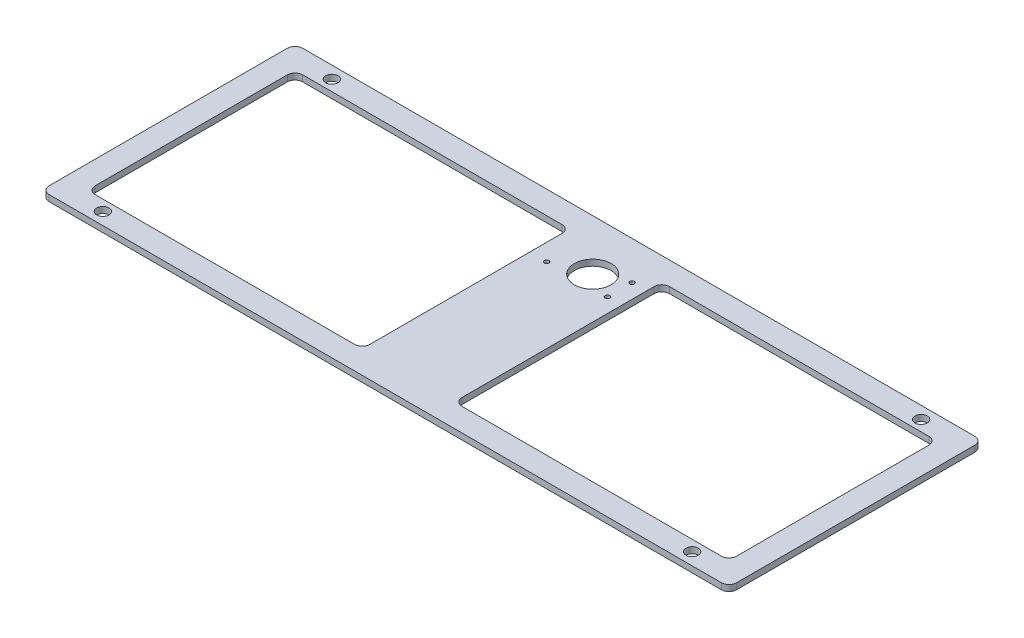
ISO-10303-21;
HEADER;
FILE_DESCRIPTION(('STEP AP214'),'2;1');
FILE_NAME('part.step','',(''),(''),'','','');
FILE_SCHEMA(('AUTOMOTIVE_DESIGN { 1 0 10303 214 1 1 1 1 }'));
ENDSEC;
DATA;
#1=APPLICATION_CONTEXT('core data for automotive mechanical design processes');
#2=APPLICATION_PROTOCOL_DEFINITION('international standard','automotive_design',2000,#1);
#3=PRODUCT_CONTEXT('',#1,'mechanical');
#4=PRODUCT('Part','Part','',(#3));
#5=PRODUCT_RELATED_PRODUCT_CATEGORY('part','',(#4));
#6=PRODUCT_DEFINITION_FORMATION('','',#4);
#7=PRODUCT_DEFINITION_CONTEXT('part definition',#1,'design');
#8=PRODUCT_DEFINITION('design','',#6,#7);
#9=PRODUCT_DEFINITION_SHAPE('','',#8);
#10=(LENGTH_UNIT() NAMED_UNIT(*) SI_UNIT(.MILLI.,.METRE.));
#11=(NAMED_UNIT(*) PLANE_ANGLE_UNIT() SI_UNIT($,.RADIAN.));
#12=(NAMED_UNIT(*) SI_UNIT($,.STERADIAN.) SOLID_ANGLE_UNIT());
#13=UNCERTAINTY_MEASURE_WITH_UNIT(LENGTH_MEASURE(1.E-05),#10,'distance_accuracy_value','');
#14=(GEOMETRIC_REPRESENTATION_CONTEXT(3) GLOBAL_UNCERTAINTY_ASSIGNED_CONTEXT((#13)) GLOBAL_UNIT_ASSIGNED_CONTEXT((#10,
#11,#12)) REPRESENTATION_CONTEXT('',''));
#15=CARTESIAN_POINT('',(0.,0.,0.));
#16=DIRECTION('',(0.,0.,1.));
#17=DIRECTION('',(1.,0.,0.));
#18=AXIS2_PLACEMENT_3D('',#15,#16,#17);
#19=CARTESIAN_POINT('',(-60.9595687331536,-2.,-49.455525606469));
#20=DIRECTION('',(0.,0.,-1.));
#21=DIRECTION('',(-1.,0.,0.));
#22=AXIS2_PLACEMENT_3D('',#19,#20,#21);
#23=PLANE('',#22);
#24=DIRECTION('',(-1.,0.,0.));
#25=VECTOR('',#24,1.);
#26=CARTESIAN_POINT('',(-60.9595687331536,0.,-49.455525606469));
#27=LINE('',#26,#25);
#28=CARTESIAN_POINT('',(148.540431266846,0.,-49.455525606469));
#29=VERTEX_POINT('',#28);
#30=CARTESIAN_POINT('',(-70.4595687331536,0.,-49.455525606469));
#31=VERTEX_POINT('',#30);
#32=EDGE_CURVE('E311',#29,#31,#27,.T.);
#33=ORIENTED_EDGE('',*,*,#32,.F.);
#34=DIRECTION('',(0.,1.,0.));
#35=VECTOR('',#34,1.);
#36=CARTESIAN_POINT('',(148.540431266846,-2.,-49.455525606469));
#37=LINE('',#36,#35);
#38=CARTESIAN_POINT('',(148.540431266846,-2.,-49.455525606469));
#39=VERTEX_POINT('',#38);
#40=EDGE_CURVE('E208',#29,#39,#37,.F.);
#41=ORIENTED_EDGE('',*,*,#40,.T.);
#42=DIRECTION('',(-1.,0.,0.));
#43=VECTOR('',#42,1.);
#44=CARTESIAN_POINT('',(-60.9595687331536,-2.,-49.455525606469));
#45=LINE('',#44,#43);
#46=CARTESIAN_POINT('',(-70.4595687331536,-2.,-49.455525606469));
#47=VERTEX_POINT('',#46);
#48=EDGE_CURVE('E310',#39,#47,#45,.T.);
#49=ORIENTED_EDGE('',*,*,#48,.T.);
#50=DIRECTION('',(0.,-1.,0.));
#51=VECTOR('',#50,1.);
#52=CARTESIAN_POINT('',(-70.4595687331536,0.,-49.455525606469));
#53=LINE('',#52,#51);
#54=EDGE_CURVE('E213',#47,#31,#53,.F.);
#55=ORIENTED_EDGE('',*,*,#54,.T.);
#56=EDGE_LOOP('',(#33,#41,#49,#55));
#57=FACE_BOUND('',#56,.T.);
#58=ADVANCED_FACE('F40',(#57),#23,.T.);
#59=CARTESIAN_POINT('',(-60.9595687331536,-2.,33.144474393531));
#60=DIRECTION('',(0.,0.,1.));
#61=DIRECTION('',(1.,0.,0.));
#62=AXIS2_PLACEMENT_3D('',#59,#60,#61);
#63=PLANE('',#62);
#64=DIRECTION('',(1.,0.,0.));
#65=VECTOR('',#64,1.);
#66=CARTESIAN_POINT('',(-60.9595687331536,-2.,33.144474393531));
#67=LINE('',#66,#65);
#68=CARTESIAN_POINT('',(-70.4595687331536,-2.,33.144474393531));
#69=VERTEX_POINT('',#68);
#70=CARTESIAN_POINT('',(148.540431266846,-2.,33.144474393531));
#71=VERTEX_POINT('',#70);
#72=EDGE_CURVE('E307',#69,#71,#67,.T.);
#73=ORIENTED_EDGE('',*,*,#72,.T.);
#74=DIRECTION('',(0.,-1.,0.));
#75=VECTOR('',#74,1.);
#76=CARTESIAN_POINT('',(148.540431266846,0.,33.144474393531));
#77=LINE('',#76,#75);
#78=CARTESIAN_POINT('',(148.540431266846,0.,33.144474393531));
#79=VERTEX_POINT('',#78);
#80=EDGE_CURVE('E341',#71,#79,#77,.F.);
#81=ORIENTED_EDGE('',*,*,#80,.T.);
#82=DIRECTION('',(1.,0.,0.));
#83=VECTOR('',#82,1.);
#84=CARTESIAN_POINT('',(-60.9595687331536,0.,33.144474393531));
#85=LINE('',#84,#83);
#86=CARTESIAN_POINT('',(-70.4595687331536,0.,33.144474393531));
#87=VERTEX_POINT('',#86);
#88=EDGE_CURVE('E304',#87,#79,#85,.T.);
#89=ORIENTED_EDGE('',*,*,#88,.F.);
#90=DIRECTION('',(0.,1.,0.));
#91=VECTOR('',#90,1.);
#92=CARTESIAN_POINT('',(-70.4595687331536,-2.,33.144474393531));
#93=LINE('',#92,#91);
#94=EDGE_CURVE('E339',#87,#69,#93,.F.);
#95=ORIENTED_EDGE('',*,*,#94,.T.);
#96=EDGE_LOOP('',(#73,#81,#89,#95));
#97=FACE_BOUND('',#96,.T.);
#98=ADVANCED_FACE('F458',(#97),#63,.T.);
#99=CARTESIAN_POINT('',(0.,-2.,0.));
#100=DIRECTION('',(0.,1.,0.));
#101=DIRECTION('',(0.,0.,1.));
#102=AXIS2_PLACEMENT_3D('',#99,#100,#101);
#103=PLANE('',#102);
#104=CARTESIAN_POINT('',(49.3404791068463,-2.,-36.955525606469));
#105=DIRECTION('',(0.,1.,0.));
#106=DIRECTION('',(0.,0.,1.));
#107=AXIS2_PLACEMENT_3D('',#104,#105,#106);
#108=CIRCLE('',#107,0.750000000000001);
#109=CARTESIAN_POINT('',(49.3404791068463,-2.,-36.205525606469));
#110=VERTEX_POINT('',#109);
#111=EDGE_CURVE('E576',#110,#110,#108,.T.);
#112=ORIENTED_EDGE('',*,*,#111,.T.);
#113=EDGE_LOOP('',(#112));
#114=FACE_BOUND('',#113,.T.);
#115=CARTESIAN_POINT('',(49.3404791068463,-2.,-28.955525606469));
#116=DIRECTION('',(0.,1.,0.));
#117=DIRECTION('',(0.,0.,1.));
#118=AXIS2_PLACEMENT_3D('',#115,#116,#117);
#119=CIRCLE('',#118,0.750000000000001);
#120=CARTESIAN_POINT('',(49.3404791068463,-2.,-28.205525606469));
#121=VERTEX_POINT('',#120);
#122=EDGE_CURVE('E586',#121,#121,#119,.T.);
#123=ORIENTED_EDGE('',*,*,#122,.T.);
#124=EDGE_LOOP('',(#123));
#125=FACE_BOUND('',#124,.T.);
#126=CARTESIAN_POINT('',(29.5404791068463,-2.,-28.955525606469));
#127=DIRECTION('',(0.,1.,0.));
#128=DIRECTION('',(0.,0.,1.));
#129=AXIS2_PLACEMENT_3D('',#126,#127,#128);
#130=CIRCLE('',#129,0.750000000000001);
#131=CARTESIAN_POINT('',(29.5404791068463,-2.,-28.205525606469));
#132=VERTEX_POINT('',#131);
#133=EDGE_CURVE('E592',#132,#132,#130,.T.);
#134=ORIENTED_EDGE('',*,*,#133,.T.);
#135=EDGE_LOOP('',(#134));
#136=FACE_BOUND('',#135,.T.);
#137=CARTESIAN_POINT('',(40.5404791068463,-2.,-32.955525606469));
#138=DIRECTION('',(0.,1.,0.));
#139=DIRECTION('',(0.,0.,1.));
#140=AXIS2_PLACEMENT_3D('',#137,#138,#139);
#141=CIRCLE('',#140,6.);
#142=CARTESIAN_POINT('',(40.5404791068463,-2.,-26.955525606469));
#143=VERTEX_POINT('',#142);
#144=EDGE_CURVE('E596',#143,#143,#141,.T.);
#145=ORIENTED_EDGE('',*,*,#144,.T.);
#146=EDGE_LOOP('',(#145));
#147=FACE_BOUND('',#146,.T.);
#148=DIRECTION('',(-1.,0.,0.));
#149=VECTOR('',#148,1.);
#150=CARTESIAN_POINT('',(-53.4595687331536,-2.,-41.955525606469));
#151=LINE('',#150,#149);
#152=CARTESIAN_POINT('',(21.5404312668464,-2.,-41.955525606469));
#153=VERTEX_POINT('',#152);
#154=CARTESIAN_POINT('',(-62.9595687331536,-2.,-41.955525606469));
#155=VERTEX_POINT('',#154);
#156=EDGE_CURVE('E254',#153,#155,#151,.T.);
#157=ORIENTED_EDGE('',*,*,#156,.T.);
#158=CARTESIAN_POINT('',(-62.9595687331536,-2.,-39.455525606469));
#159=DIRECTION('',(0.,1.,0.));
#160=DIRECTION('',(0.,0.,1.));
#161=AXIS2_PLACEMENT_3D('',#158,#159,#160);
#162=CIRCLE('',#161,2.5);
#163=CARTESIAN_POINT('',(-65.4595687331536,-2.,-39.455525606469));
#164=VERTEX_POINT('',#163);
#165=EDGE_CURVE('E11',#155,#164,#162,.T.);
#166=ORIENTED_EDGE('',*,*,#165,.T.);
#167=DIRECTION('',(0.,0.,1.));
#168=VECTOR('',#167,1.);
#169=CARTESIAN_POINT('',(-65.4595687331536,-2.,25.644474393531));
#170=LINE('',#169,#168);
#171=CARTESIAN_POINT('',(-65.4595687331536,-2.,23.144474393531));
#172=VERTEX_POINT('',#171);
#173=EDGE_CURVE('E231',#164,#172,#170,.T.);
#174=ORIENTED_EDGE('',*,*,#173,.T.);
#175=CARTESIAN_POINT('',(-62.9595687331536,-2.,23.144474393531));
#176=DIRECTION('',(0.,1.,0.));
#177=DIRECTION('',(0.,0.,1.));
#178=AXIS2_PLACEMENT_3D('',#175,#176,#177);
#179=CIRCLE('',#178,2.5);
#180=CARTESIAN_POINT('',(-62.9595687331536,-2.,25.644474393531));
#181=VERTEX_POINT('',#180);
#182=EDGE_CURVE('E396',#172,#181,#179,.T.);
#183=ORIENTED_EDGE('',*,*,#182,.T.);
#184=DIRECTION('',(1.,0.,0.));
#185=VECTOR('',#184,1.);
#186=CARTESIAN_POINT('',(-53.4595687331536,-2.,25.644474393531));
#187=LINE('',#186,#185);
#188=CARTESIAN_POINT('',(21.5404312668464,-2.,25.644474393531));
#189=VERTEX_POINT('',#188);
#190=EDGE_CURVE('E247',#181,#189,#187,.T.);
#191=ORIENTED_EDGE('',*,*,#190,.T.);
#192=CARTESIAN_POINT('',(21.5404312668464,-2.,23.144474393531));
#193=DIRECTION('',(0.,1.,0.));
#194=DIRECTION('',(0.,0.,1.));
#195=AXIS2_PLACEMENT_3D('',#192,#193,#194);
#196=CIRCLE('',#195,2.5);
#197=CARTESIAN_POINT('',(24.0404312668464,-2.,23.144474393531));
#198=VERTEX_POINT('',#197);
#199=EDGE_CURVE('E392',#189,#198,#196,.T.);
#200=ORIENTED_EDGE('',*,*,#199,.T.);
#201=DIRECTION('',(0.,0.,-1.));
#202=VECTOR('',#201,1.);
#203=CARTESIAN_POINT('',(24.0404312668464,-2.,-41.955525606469));
#204=LINE('',#203,#202);
#205=CARTESIAN_POINT('',(24.0404312668464,-2.,-39.455525606469));
#206=VERTEX_POINT('',#205);
#207=EDGE_CURVE('E250',#198,#206,#204,.T.);
#208=ORIENTED_EDGE('',*,*,#207,.T.);
#209=CARTESIAN_POINT('',(21.5404312668464,-2.,-39.455525606469));
#210=DIRECTION('',(0.,1.,0.));
#211=DIRECTION('',(0.,0.,1.));
#212=AXIS2_PLACEMENT_3D('',#209,#210,#211);
#213=CIRCLE('',#212,2.5);
#214=EDGE_CURVE('E404',#206,#153,#213,.T.);
#215=ORIENTED_EDGE('',*,*,#214,.T.);
#216=EDGE_LOOP('',(#157,#166,#174,#183,#191,#200,#208,#215));
#217=FACE_BOUND('',#216,.T.);
#218=DIRECTION('',(1.,0.,0.));
#219=VECTOR('',#218,1.);
#220=CARTESIAN_POINT('',(54.0404312668464,-2.,25.644474393531));
#221=LINE('',#220,#219);
#222=CARTESIAN_POINT('',(56.5404312668464,-2.,25.644474393531));
#223=VERTEX_POINT('',#222);
#224=CARTESIAN_POINT('',(141.040431266846,-2.,25.6444743935309));
#225=VERTEX_POINT('',#224);
#226=EDGE_CURVE('E270',#223,#225,#221,.T.);
#227=ORIENTED_EDGE('',*,*,#226,.T.);
#228=CARTESIAN_POINT('',(141.040431266846,-2.,23.1444743935309));
#229=DIRECTION('',(0.,1.,0.));
#230=DIRECTION('',(0.,0.,1.));
#231=AXIS2_PLACEMENT_3D('',#228,#229,#230);
#232=CIRCLE('',#231,2.5);
#233=CARTESIAN_POINT('',(143.540431266846,-2.,23.1444743935309));
#234=VERTEX_POINT('',#233);
#235=EDGE_CURVE('E384',#225,#234,#232,.T.);
#236=ORIENTED_EDGE('',*,*,#235,.T.);
#237=DIRECTION('',(0.,0.,-1.));
#238=VECTOR('',#237,1.);
#239=CARTESIAN_POINT('',(143.540431266846,-2.,25.6444743935309));
#240=LINE('',#239,#238);
#241=CARTESIAN_POINT('',(143.540431266846,-2.,-39.455525606469));
#242=VERTEX_POINT('',#241);
#243=EDGE_CURVE('E601',#234,#242,#240,.T.);
#244=ORIENTED_EDGE('',*,*,#243,.T.);
#245=CARTESIAN_POINT('',(141.040431266846,-2.,-39.455525606469));
#246=DIRECTION('',(0.,1.,0.));
#247=DIRECTION('',(0.,0.,1.));
#248=AXIS2_PLACEMENT_3D('',#245,#246,#247);
#249=CIRCLE('',#248,2.5);
#250=CARTESIAN_POINT('',(141.040431266846,-2.,-41.955525606469));
#251=VERTEX_POINT('',#250);
#252=EDGE_CURVE('E380',#242,#251,#249,.T.);
#253=ORIENTED_EDGE('',*,*,#252,.T.);
#254=DIRECTION('',(-1.,0.,0.));
#255=VECTOR('',#254,1.);
#256=CARTESIAN_POINT('',(54.0404312668464,-2.,-41.955525606469));
#257=LINE('',#256,#255);
#258=CARTESIAN_POINT('',(56.5404312668464,-2.,-41.955525606469));
#259=VERTEX_POINT('',#258);
#260=EDGE_CURVE('E262',#251,#259,#257,.T.);
#261=ORIENTED_EDGE('',*,*,#260,.T.);
#262=CARTESIAN_POINT('',(56.5404312668464,-2.,-39.455525606469));
#263=DIRECTION('',(0.,1.,0.));
#264=DIRECTION('',(0.,0.,1.));
#265=AXIS2_PLACEMENT_3D('',#262,#263,#264);
#266=CIRCLE('',#265,2.5);
#267=CARTESIAN_POINT('',(54.0404312668464,-2.,-39.455525606469));
#268=VERTEX_POINT('',#267);
#269=EDGE_CURVE('E400',#259,#268,#266,.T.);
#270=ORIENTED_EDGE('',*,*,#269,.T.);
#271=DIRECTION('',(0.,0.,1.));
#272=VECTOR('',#271,1.);
#273=CARTESIAN_POINT('',(54.0404312668464,-2.,-41.955525606469));
#274=LINE('',#273,#272);
#275=CARTESIAN_POINT('',(54.0404312668464,-2.,23.144474393531));
#276=VERTEX_POINT('',#275);
#277=EDGE_CURVE('E267',#268,#276,#274,.T.);
#278=ORIENTED_EDGE('',*,*,#277,.T.);
#279=CARTESIAN_POINT('',(56.5404312668464,-2.,23.144474393531));
#280=DIRECTION('',(0.,1.,0.));
#281=DIRECTION('',(0.,0.,1.));
#282=AXIS2_PLACEMENT_3D('',#279,#280,#281);
#283=CIRCLE('',#282,2.5);
#284=EDGE_CURVE('E388',#276,#223,#283,.T.);
#285=ORIENTED_EDGE('',*,*,#284,.T.);
#286=EDGE_LOOP('',(#227,#236,#244,#253,#261,#270,#278,#285));
#287=FACE_BOUND('',#286,.T.);
#288=CARTESIAN_POINT('',(135.040431266846,-2.,-45.455525606469));
#289=DIRECTION('',(0.,1.,0.));
#290=DIRECTION('',(0.,0.,1.));
#291=AXIS2_PLACEMENT_3D('',#288,#289,#290);
#292=CIRCLE('',#291,2.);
#293=CARTESIAN_POINT('',(135.040431266846,-2.,-43.455525606469));
#294=VERTEX_POINT('',#293);
#295=EDGE_CURVE('E296',#294,#294,#292,.T.);
#296=ORIENTED_EDGE('',*,*,#295,.T.);
#297=EDGE_LOOP('',(#296));
#298=FACE_BOUND('',#297,.T.);
#299=CARTESIAN_POINT('',(135.040431266846,-2.,29.144474393531));
#300=DIRECTION('',(0.,1.,0.));
#301=DIRECTION('',(0.,0.,1.));
#302=AXIS2_PLACEMENT_3D('',#299,#300,#301);
#303=CIRCLE('',#302,2.);
#304=CARTESIAN_POINT('',(135.040431266846,-2.,31.144474393531));
#305=VERTEX_POINT('',#304);
#306=EDGE_CURVE('E290',#305,#305,#303,.T.);
#307=ORIENTED_EDGE('',*,*,#306,.T.);
#308=EDGE_LOOP('',(#307));
#309=FACE_BOUND('',#308,.T.);
#310=CARTESIAN_POINT('',(-56.9595687331536,-2.,29.144474393531));
#311=DIRECTION('',(0.,1.,0.));
#312=DIRECTION('',(0.,0.,1.));
#313=AXIS2_PLACEMENT_3D('',#310,#311,#312);
#314=CIRCLE('',#313,2.);
#315=CARTESIAN_POINT('',(-56.9595687331536,-2.,31.144474393531));
#316=VERTEX_POINT('',#315);
#317=EDGE_CURVE('E283',#316,#316,#314,.T.);
#318=ORIENTED_EDGE('',*,*,#317,.T.);
#319=EDGE_LOOP('',(#318));
#320=FACE_BOUND('',#319,.T.);
#321=CARTESIAN_POINT('',(-56.9595687331536,-2.,-45.455525606469));
#322=DIRECTION('',(0.,1.,0.));
#323=DIRECTION('',(0.,0.,1.));
#324=AXIS2_PLACEMENT_3D('',#321,#322,#323);
#325=CIRCLE('',#324,2.);
#326=CARTESIAN_POINT('',(-56.9595687331536,-2.,-43.455525606469));
#327=VERTEX_POINT('',#326);
#328=EDGE_CURVE('E301',#327,#327,#325,.T.);
#329=ORIENTED_EDGE('',*,*,#328,.T.);
#330=EDGE_LOOP('',(#329));
#331=FACE_BOUND('',#330,.T.);
#332=ORIENTED_EDGE('',*,*,#48,.F.);
#333=CARTESIAN_POINT('',(148.540431266846,-2.,-46.955525606469));
#334=DIRECTION('',(0.,1.,0.));
#335=DIRECTION('',(0.,0.,1.));
#336=AXIS2_PLACEMENT_3D('',#333,#334,#335);
#337=CIRCLE('',#336,2.5);
#338=CARTESIAN_POINT('',(151.040431266846,-2.,-46.955525606469));
#339=VERTEX_POINT('',#338);
#340=EDGE_CURVE('E327',#39,#339,#337,.F.);
#341=ORIENTED_EDGE('',*,*,#340,.T.);
#342=DIRECTION('',(0.,0.,-1.));
#343=VECTOR('',#342,1.);
#344=CARTESIAN_POINT('',(151.040431266846,-2.,-49.455525606469));
#345=LINE('',#344,#343);
#346=CARTESIAN_POINT('',(151.040431266846,-2.,30.644474393531));
#347=VERTEX_POINT('',#346);
#348=EDGE_CURVE('E224',#347,#339,#345,.T.);
#349=ORIENTED_EDGE('',*,*,#348,.F.);
#350=CARTESIAN_POINT('',(148.540431266846,-2.,30.644474393531));
#351=DIRECTION('',(0.,1.,0.));
#352=DIRECTION('',(0.,0.,1.));
#353=AXIS2_PLACEMENT_3D('',#350,#351,#352);
#354=CIRCLE('',#353,2.5);
#355=EDGE_CURVE('E325',#347,#71,#354,.F.);
#356=ORIENTED_EDGE('',*,*,#355,.T.);
#357=ORIENTED_EDGE('',*,*,#72,.F.);
#358=CARTESIAN_POINT('',(-70.4595687331536,-2.,30.644474393531));
#359=DIRECTION('',(0.,1.,0.));
#360=DIRECTION('',(0.,0.,1.));
#361=AXIS2_PLACEMENT_3D('',#358,#359,#360);
#362=CIRCLE('',#361,2.5);
#363=CARTESIAN_POINT('',(-72.9595687331536,-2.,30.644474393531));
#364=VERTEX_POINT('',#363);
#365=EDGE_CURVE('E55',#69,#364,#362,.F.);
#366=ORIENTED_EDGE('',*,*,#365,.T.);
#367=DIRECTION('',(0.,0.,1.));
#368=VECTOR('',#367,1.);
#369=CARTESIAN_POINT('',(-72.9595687331536,-2.,-49.455525606469));
#370=LINE('',#369,#368);
#371=CARTESIAN_POINT('',(-72.9595687331536,-2.,-46.955525606469));
#372=VERTEX_POINT('',#371);
#373=EDGE_CURVE('E233',#372,#364,#370,.T.);
#374=ORIENTED_EDGE('',*,*,#373,.F.);
#375=CARTESIAN_POINT('',(-70.4595687331536,-2.,-46.955525606469));
#376=DIRECTION('',(0.,1.,0.));
#377=DIRECTION('',(0.,0.,1.));
#378=AXIS2_PLACEMENT_3D('',#375,#376,#377);
#379=CIRCLE('',#378,2.5);
#380=EDGE_CURVE('E63',#372,#47,#379,.F.);
#381=ORIENTED_EDGE('',*,*,#380,.T.);
#382=EDGE_LOOP('',(#332,#341,#349,#356,#357,#366,#374,#381));
#383=FACE_BOUND('',#382,.T.);
#384=ADVANCED_FACE('F421',(#114,#125,#136,#147,#217,#287,#298,#309,#320,#331,#383),#103,.F.);
#385=CARTESIAN_POINT('',(0.,0.,0.));
#386=DIRECTION('',(0.,1.,0.));
#387=DIRECTION('',(0.,0.,1.));
#388=AXIS2_PLACEMENT_3D('',#385,#386,#387);
#389=PLANE('',#388);
#390=CARTESIAN_POINT('',(49.3404791068463,0.,-36.955525606469));
#391=DIRECTION('',(0.,1.,0.));
#392=DIRECTION('',(0.,0.,1.));
#393=AXIS2_PLACEMENT_3D('',#390,#391,#392);
#394=CIRCLE('',#393,0.750000000000001);
#395=CARTESIAN_POINT('',(49.3404791068463,0.,-36.205525606469));
#396=VERTEX_POINT('',#395);
#397=EDGE_CURVE('E579',#396,#396,#394,.T.);
#398=ORIENTED_EDGE('',*,*,#397,.F.);
#399=EDGE_LOOP('',(#398));
#400=FACE_BOUND('',#399,.T.);
#401=CARTESIAN_POINT('',(49.3404791068463,0.,-28.955525606469));
#402=DIRECTION('',(0.,1.,0.));
#403=DIRECTION('',(0.,0.,1.));
#404=AXIS2_PLACEMENT_3D('',#401,#402,#403);
#405=CIRCLE('',#404,0.750000000000001);
#406=CARTESIAN_POINT('',(49.3404791068463,0.,-28.205525606469));
#407=VERTEX_POINT('',#406);
#408=EDGE_CURVE('E581',#407,#407,#405,.T.);
#409=ORIENTED_EDGE('',*,*,#408,.F.);
#410=EDGE_LOOP('',(#409));
#411=FACE_BOUND('',#410,.T.);
#412=CARTESIAN_POINT('',(29.5404791068463,0.,-28.955525606469));
#413=DIRECTION('',(0.,1.,0.));
#414=DIRECTION('',(0.,0.,1.));
#415=AXIS2_PLACEMENT_3D('',#412,#413,#414);
#416=CIRCLE('',#415,0.750000000000001);
#417=CARTESIAN_POINT('',(29.5404791068463,0.,-28.205525606469));
#418=VERTEX_POINT('',#417);
#419=EDGE_CURVE('E589',#418,#418,#416,.T.);
#420=ORIENTED_EDGE('',*,*,#419,.F.);
#421=EDGE_LOOP('',(#420));
#422=FACE_BOUND('',#421,.T.);
#423=CARTESIAN_POINT('',(40.5404791068463,0.,-32.955525606469));
#424=DIRECTION('',(0.,1.,0.));
#425=DIRECTION('',(0.,0.,1.));
#426=AXIS2_PLACEMENT_3D('',#423,#424,#425);
#427=CIRCLE('',#426,6.);
#428=CARTESIAN_POINT('',(40.5404791068463,0.,-26.955525606469));
#429=VERTEX_POINT('',#428);
#430=EDGE_CURVE('E595',#429,#429,#427,.T.);
#431=ORIENTED_EDGE('',*,*,#430,.F.);
#432=EDGE_LOOP('',(#431));
#433=FACE_BOUND('',#432,.T.);
#434=DIRECTION('',(1.,0.,0.));
#435=VECTOR('',#434,1.);
#436=CARTESIAN_POINT('',(-53.4595687331536,0.,25.644474393531));
#437=LINE('',#436,#435);
#438=CARTESIAN_POINT('',(-62.9595687331536,0.,25.644474393531));
#439=VERTEX_POINT('',#438);
#440=CARTESIAN_POINT('',(21.5404312668464,0.,25.644474393531));
#441=VERTEX_POINT('',#440);
#442=EDGE_CURVE('E258',#439,#441,#437,.T.);
#443=ORIENTED_EDGE('',*,*,#442,.F.);
#444=CARTESIAN_POINT('',(-62.9595687331536,0.,23.144474393531));
#445=DIRECTION('',(0.,1.,0.));
#446=DIRECTION('',(0.,0.,1.));
#447=AXIS2_PLACEMENT_3D('',#444,#445,#446);
#448=CIRCLE('',#447,2.5);
#449=CARTESIAN_POINT('',(-65.4595687331536,0.,23.144474393531));
#450=VERTEX_POINT('',#449);
#451=EDGE_CURVE('E394',#439,#450,#448,.F.);
#452=ORIENTED_EDGE('',*,*,#451,.T.);
#453=DIRECTION('',(0.,0.,1.));
#454=VECTOR('',#453,1.);
#455=CARTESIAN_POINT('',(-65.4595687331536,0.,25.644474393531));
#456=LINE('',#455,#454);
#457=CARTESIAN_POINT('',(-65.4595687331536,0.,-39.455525606469));
#458=VERTEX_POINT('',#457);
#459=EDGE_CURVE('E236',#458,#450,#456,.T.);
#460=ORIENTED_EDGE('',*,*,#459,.F.);
#461=CARTESIAN_POINT('',(-62.9595687331536,0.,-39.455525606469));
#462=DIRECTION('',(0.,1.,0.));
#463=DIRECTION('',(0.,0.,1.));
#464=AXIS2_PLACEMENT_3D('',#461,#462,#463);
#465=CIRCLE('',#464,2.5);
#466=CARTESIAN_POINT('',(-62.9595687331536,0.,-41.955525606469));
#467=VERTEX_POINT('',#466);
#468=EDGE_CURVE('E48',#458,#467,#465,.F.);
#469=ORIENTED_EDGE('',*,*,#468,.T.);
#470=DIRECTION('',(-1.,0.,0.));
#471=VECTOR('',#470,1.);
#472=CARTESIAN_POINT('',(-53.4595687331536,0.,-41.955525606469));
#473=LINE('',#472,#471);
#474=CARTESIAN_POINT('',(21.5404312668464,0.,-41.955525606469));
#475=VERTEX_POINT('',#474);
#476=EDGE_CURVE('E251',#475,#467,#473,.T.);
#477=ORIENTED_EDGE('',*,*,#476,.F.);
#478=CARTESIAN_POINT('',(21.5404312668464,0.,-39.455525606469));
#479=DIRECTION('',(0.,1.,0.));
#480=DIRECTION('',(0.,0.,1.));
#481=AXIS2_PLACEMENT_3D('',#478,#479,#480);
#482=CIRCLE('',#481,2.5);
#483=CARTESIAN_POINT('',(24.0404312668464,0.,-39.455525606469));
#484=VERTEX_POINT('',#483);
#485=EDGE_CURVE('E402',#475,#484,#482,.F.);
#486=ORIENTED_EDGE('',*,*,#485,.T.);
#487=DIRECTION('',(0.,0.,-1.));
#488=VECTOR('',#487,1.);
#489=CARTESIAN_POINT('',(24.0404312668464,0.,-41.955525606469));
#490=LINE('',#489,#488);
#491=CARTESIAN_POINT('',(24.0404312668464,0.,23.144474393531));
#492=VERTEX_POINT('',#491);
#493=EDGE_CURVE('E261',#492,#484,#490,.T.);
#494=ORIENTED_EDGE('',*,*,#493,.F.);
#495=CARTESIAN_POINT('',(21.5404312668464,0.,23.144474393531));
#496=DIRECTION('',(0.,1.,0.));
#497=DIRECTION('',(0.,0.,1.));
#498=AXIS2_PLACEMENT_3D('',#495,#496,#497);
#499=CIRCLE('',#498,2.5);
#500=EDGE_CURVE('E390',#492,#441,#499,.F.);
#501=ORIENTED_EDGE('',*,*,#500,.T.);
#502=EDGE_LOOP('',(#443,#452,#460,#469,#477,#486,#494,#501));
#503=FACE_BOUND('',#502,.T.);
#504=DIRECTION('',(-1.,0.,0.));
#505=VECTOR('',#504,1.);
#506=CARTESIAN_POINT('',(54.0404312668464,0.,-41.955525606469));
#507=LINE('',#506,#505);
#508=CARTESIAN_POINT('',(141.040431266846,0.,-41.955525606469));
#509=VERTEX_POINT('',#508);
#510=CARTESIAN_POINT('',(56.5404312668464,0.,-41.955525606469));
#511=VERTEX_POINT('',#510);
#512=EDGE_CURVE('E271',#509,#511,#507,.T.);
#513=ORIENTED_EDGE('',*,*,#512,.F.);
#514=CARTESIAN_POINT('',(141.040431266846,0.,-39.455525606469));
#515=DIRECTION('',(0.,1.,0.));
#516=DIRECTION('',(0.,0.,1.));
#517=AXIS2_PLACEMENT_3D('',#514,#515,#516);
#518=CIRCLE('',#517,2.5);
#519=CARTESIAN_POINT('',(143.540431266846,0.,-39.455525606469));
#520=VERTEX_POINT('',#519);
#521=EDGE_CURVE('E378',#509,#520,#518,.F.);
#522=ORIENTED_EDGE('',*,*,#521,.T.);
#523=DIRECTION('',(0.,0.,-1.));
#524=VECTOR('',#523,1.);
#525=CARTESIAN_POINT('',(143.540431266846,0.,25.6444743935309));
#526=LINE('',#525,#524);
#527=CARTESIAN_POINT('',(143.540431266846,0.,23.1444743935309));
#528=VERTEX_POINT('',#527);
#529=EDGE_CURVE('E239',#528,#520,#526,.T.);
#530=ORIENTED_EDGE('',*,*,#529,.F.);
#531=CARTESIAN_POINT('',(141.040431266846,0.,23.1444743935309));
#532=DIRECTION('',(0.,1.,0.));
#533=DIRECTION('',(0.,0.,1.));
#534=AXIS2_PLACEMENT_3D('',#531,#532,#533);
#535=CIRCLE('',#534,2.5);
#536=CARTESIAN_POINT('',(141.040431266846,0.,25.6444743935309));
#537=VERTEX_POINT('',#536);
#538=EDGE_CURVE('E382',#528,#537,#535,.F.);
#539=ORIENTED_EDGE('',*,*,#538,.T.);
#540=DIRECTION('',(1.,0.,0.));
#541=VECTOR('',#540,1.);
#542=CARTESIAN_POINT('',(54.0404312668464,0.,25.644474393531));
#543=LINE('',#542,#541);
#544=CARTESIAN_POINT('',(56.5404312668464,0.,25.644474393531));
#545=VERTEX_POINT('',#544);
#546=EDGE_CURVE('E278',#545,#537,#543,.T.);
#547=ORIENTED_EDGE('',*,*,#546,.F.);
#548=CARTESIAN_POINT('',(56.5404312668464,0.,23.144474393531));
#549=DIRECTION('',(0.,1.,0.));
#550=DIRECTION('',(0.,0.,1.));
#551=AXIS2_PLACEMENT_3D('',#548,#549,#550);
#552=CIRCLE('',#551,2.5);
#553=CARTESIAN_POINT('',(54.0404312668464,0.,23.144474393531));
#554=VERTEX_POINT('',#553);
#555=EDGE_CURVE('E386',#545,#554,#552,.F.);
#556=ORIENTED_EDGE('',*,*,#555,.T.);
#557=DIRECTION('',(0.,0.,1.));
#558=VECTOR('',#557,1.);
#559=CARTESIAN_POINT('',(54.0404312668464,0.,-41.955525606469));
#560=LINE('',#559,#558);
#561=CARTESIAN_POINT('',(54.0404312668464,0.,-39.455525606469));
#562=VERTEX_POINT('',#561);
#563=EDGE_CURVE('E246',#562,#554,#560,.T.);
#564=ORIENTED_EDGE('',*,*,#563,.F.);
#565=CARTESIAN_POINT('',(56.5404312668464,0.,-39.455525606469));
#566=DIRECTION('',(0.,1.,0.));
#567=DIRECTION('',(0.,0.,1.));
#568=AXIS2_PLACEMENT_3D('',#565,#566,#567);
#569=CIRCLE('',#568,2.5);
#570=EDGE_CURVE('E398',#562,#511,#569,.F.);
#571=ORIENTED_EDGE('',*,*,#570,.T.);
#572=EDGE_LOOP('',(#513,#522,#530,#539,#547,#556,#564,#571));
#573=FACE_BOUND('',#572,.T.);
#574=CARTESIAN_POINT('',(135.040431266846,0.,-45.455525606469));
#575=DIRECTION('',(0.,1.,0.));
#576=DIRECTION('',(0.,0.,1.));
#577=AXIS2_PLACEMENT_3D('',#574,#575,#576);
#578=CIRCLE('',#577,2.);
#579=CARTESIAN_POINT('',(135.040431266846,0.,-43.455525606469));
#580=VERTEX_POINT('',#579);
#581=EDGE_CURVE('E257',#580,#580,#578,.T.);
#582=ORIENTED_EDGE('',*,*,#581,.F.);
#583=EDGE_LOOP('',(#582));
#584=FACE_BOUND('',#583,.T.);
#585=CARTESIAN_POINT('',(135.040431266846,0.,29.144474393531));
#586=DIRECTION('',(0.,1.,0.));
#587=DIRECTION('',(0.,0.,1.));
#588=AXIS2_PLACEMENT_3D('',#585,#586,#587);
#589=CIRCLE('',#588,2.);
#590=CARTESIAN_POINT('',(135.040431266846,0.,31.144474393531));
#591=VERTEX_POINT('',#590);
#592=EDGE_CURVE('E293',#591,#591,#589,.T.);
#593=ORIENTED_EDGE('',*,*,#592,.F.);
#594=EDGE_LOOP('',(#593));
#595=FACE_BOUND('',#594,.T.);
#596=CARTESIAN_POINT('',(-56.9595687331536,0.,29.144474393531));
#597=DIRECTION('',(0.,1.,0.));
#598=DIRECTION('',(0.,0.,1.));
#599=AXIS2_PLACEMENT_3D('',#596,#597,#598);
#600=CIRCLE('',#599,2.);
#601=CARTESIAN_POINT('',(-56.9595687331536,0.,31.144474393531));
#602=VERTEX_POINT('',#601);
#603=EDGE_CURVE('E287',#602,#602,#600,.T.);
#604=ORIENTED_EDGE('',*,*,#603,.F.);
#605=EDGE_LOOP('',(#604));
#606=FACE_BOUND('',#605,.T.);
#607=CARTESIAN_POINT('',(-56.9595687331536,0.,-45.455525606469));
#608=DIRECTION('',(0.,1.,0.));
#609=DIRECTION('',(0.,0.,1.));
#610=AXIS2_PLACEMENT_3D('',#607,#608,#609);
#611=CIRCLE('',#610,2.);
#612=CARTESIAN_POINT('',(-56.9595687331536,0.,-43.455525606469));
#613=VERTEX_POINT('',#612);
#614=EDGE_CURVE('E286',#613,#613,#611,.T.);
#615=ORIENTED_EDGE('',*,*,#614,.F.);
#616=EDGE_LOOP('',(#615));
#617=FACE_BOUND('',#616,.T.);
#618=DIRECTION('',(0.,0.,1.));
#619=VECTOR('',#618,1.);
#620=CARTESIAN_POINT('',(151.040431266846,0.,-49.455525606469));
#621=LINE('',#620,#619);
#622=CARTESIAN_POINT('',(151.040431266846,0.,-46.955525606469));
#623=VERTEX_POINT('',#622);
#624=CARTESIAN_POINT('',(151.040431266846,0.,30.644474393531));
#625=VERTEX_POINT('',#624);
#626=EDGE_CURVE('E221',#623,#625,#621,.T.);
#627=ORIENTED_EDGE('',*,*,#626,.F.);
#628=CARTESIAN_POINT('',(148.540431266846,0.,-46.955525606469));
#629=DIRECTION('',(0.,1.,0.));
#630=DIRECTION('',(0.,0.,1.));
#631=AXIS2_PLACEMENT_3D('',#628,#629,#630);
#632=CIRCLE('',#631,2.5);
#633=EDGE_CURVE('E203',#623,#29,#632,.T.);
#634=ORIENTED_EDGE('',*,*,#633,.T.);
#635=ORIENTED_EDGE('',*,*,#32,.T.);
#636=CARTESIAN_POINT('',(-70.4595687331536,0.,-46.955525606469));
#637=DIRECTION('',(0.,1.,0.));
#638=DIRECTION('',(0.,0.,1.));
#639=AXIS2_PLACEMENT_3D('',#636,#637,#638);
#640=CIRCLE('',#639,2.5);
#641=CARTESIAN_POINT('',(-72.9595687331536,0.,-46.955525606469));
#642=VERTEX_POINT('',#641);
#643=EDGE_CURVE('E225',#31,#642,#640,.T.);
#644=ORIENTED_EDGE('',*,*,#643,.T.);
#645=DIRECTION('',(0.,0.,-1.));
#646=VECTOR('',#645,1.);
#647=CARTESIAN_POINT('',(-72.9595687331536,0.,-49.455525606469));
#648=LINE('',#647,#646);
#649=CARTESIAN_POINT('',(-72.9595687331536,0.,30.644474393531));
#650=VERTEX_POINT('',#649);
#651=EDGE_CURVE('E243',#650,#642,#648,.T.);
#652=ORIENTED_EDGE('',*,*,#651,.F.);
#653=CARTESIAN_POINT('',(-70.4595687331536,0.,30.644474393531));
#654=DIRECTION('',(0.,1.,0.));
#655=DIRECTION('',(0.,0.,1.));
#656=AXIS2_PLACEMENT_3D('',#653,#654,#655);
#657=CIRCLE('',#656,2.5);
#658=EDGE_CURVE('E318',#650,#87,#657,.T.);
#659=ORIENTED_EDGE('',*,*,#658,.T.);
#660=ORIENTED_EDGE('',*,*,#88,.T.);
#661=CARTESIAN_POINT('',(148.540431266846,0.,30.644474393531));
#662=DIRECTION('',(0.,1.,0.));
#663=DIRECTION('',(0.,0.,1.));
#664=AXIS2_PLACEMENT_3D('',#661,#662,#663);
#665=CIRCLE('',#664,2.5);
#666=EDGE_CURVE('E214',#79,#625,#665,.T.);
#667=ORIENTED_EDGE('',*,*,#666,.T.);
#668=EDGE_LOOP('',(#627,#634,#635,#644,#652,#659,#660,#667));
#669=FACE_BOUND('',#668,.T.);
#670=ADVANCED_FACE('F228',(#400,#411,#422,#433,#503,#573,#584,#595,#606,#617,#669),#389,.T.);
#671=CARTESIAN_POINT('',(-56.9595687331536,-2.,-45.455525606469));
#672=DIRECTION('',(0.,1.,0.));
#673=DIRECTION('',(0.,0.,1.));
#674=AXIS2_PLACEMENT_3D('',#671,#672,#673);
#675=CYLINDRICAL_SURFACE('',#674,2.);
#676=ORIENTED_EDGE('',*,*,#328,.F.);
#677=EDGE_LOOP('',(#676));
#678=FACE_BOUND('',#677,.T.);
#679=ORIENTED_EDGE('',*,*,#614,.T.);
#680=EDGE_LOOP('',(#679));
#681=FACE_BOUND('',#680,.T.);
#682=ADVANCED_FACE('F510',(#678,#681),#675,.F.);
#683=CARTESIAN_POINT('',(-56.9595687331536,-2.,29.144474393531));
#684=DIRECTION('',(0.,1.,0.));
#685=DIRECTION('',(0.,0.,1.));
#686=AXIS2_PLACEMENT_3D('',#683,#684,#685);
#687=CYLINDRICAL_SURFACE('',#686,2.);
#688=ORIENTED_EDGE('',*,*,#317,.F.);
#689=EDGE_LOOP('',(#688));
#690=FACE_BOUND('',#689,.T.);
#691=ORIENTED_EDGE('',*,*,#603,.T.);
#692=EDGE_LOOP('',(#691));
#693=FACE_BOUND('',#692,.T.);
#694=ADVANCED_FACE('F517',(#690,#693),#687,.F.);
#695=CARTESIAN_POINT('',(135.040431266846,-2.,29.144474393531));
#696=DIRECTION('',(0.,1.,0.));
#697=DIRECTION('',(0.,0.,1.));
#698=AXIS2_PLACEMENT_3D('',#695,#696,#697);
#699=CYLINDRICAL_SURFACE('',#698,2.);
#700=ORIENTED_EDGE('',*,*,#306,.F.);
#701=EDGE_LOOP('',(#700));
#702=FACE_BOUND('',#701,.T.);
#703=ORIENTED_EDGE('',*,*,#592,.T.);
#704=EDGE_LOOP('',(#703));
#705=FACE_BOUND('',#704,.T.);
#706=ADVANCED_FACE('F523',(#702,#705),#699,.F.);
#707=CARTESIAN_POINT('',(135.040431266846,-2.,-45.455525606469));
#708=DIRECTION('',(0.,1.,0.));
#709=DIRECTION('',(0.,0.,1.));
#710=AXIS2_PLACEMENT_3D('',#707,#708,#709);
#711=CYLINDRICAL_SURFACE('',#710,2.);
#712=ORIENTED_EDGE('',*,*,#295,.F.);
#713=EDGE_LOOP('',(#712));
#714=FACE_BOUND('',#713,.T.);
#715=ORIENTED_EDGE('',*,*,#581,.T.);
#716=EDGE_LOOP('',(#715));
#717=FACE_BOUND('',#716,.T.);
#718=ADVANCED_FACE('F519',(#714,#717),#711,.F.);
#719=CARTESIAN_POINT('',(54.0404312668464,-2.,-41.955525606469));
#720=DIRECTION('',(-1.,0.,0.));
#721=DIRECTION('',(0.,0.,1.));
#722=AXIS2_PLACEMENT_3D('',#719,#720,#721);
#723=PLANE('',#722);
#724=ORIENTED_EDGE('',*,*,#563,.T.);
#725=DIRECTION('',(0.,1.,0.));
#726=VECTOR('',#725,1.);
#727=CARTESIAN_POINT('',(54.0404312668464,-2.,23.144474393531));
#728=LINE('',#727,#726);
#729=EDGE_CURVE('E351',#554,#276,#728,.F.);
#730=ORIENTED_EDGE('',*,*,#729,.T.);
#731=ORIENTED_EDGE('',*,*,#277,.F.);
#732=DIRECTION('',(0.,1.,0.));
#733=VECTOR('',#732,1.);
#734=CARTESIAN_POINT('',(54.0404312668464,0.,-39.455525606469));
#735=LINE('',#734,#733);
#736=EDGE_CURVE('E348',#268,#562,#735,.T.);
#737=ORIENTED_EDGE('',*,*,#736,.T.);
#738=EDGE_LOOP('',(#724,#730,#731,#737));
#739=FACE_BOUND('',#738,.T.);
#740=ADVANCED_FACE('F522',(#739),#723,.F.);
#741=CARTESIAN_POINT('',(54.0404312668464,-2.,-41.955525606469));
#742=DIRECTION('',(0.,0.,-1.));
#743=DIRECTION('',(-1.,0.,0.));
#744=AXIS2_PLACEMENT_3D('',#741,#742,#743);
#745=PLANE('',#744);
#746=ORIENTED_EDGE('',*,*,#260,.F.);
#747=DIRECTION('',(0.,1.,0.));
#748=VECTOR('',#747,1.);
#749=CARTESIAN_POINT('',(141.040431266846,0.,-41.955525606469));
#750=LINE('',#749,#748);
#751=EDGE_CURVE('E331',#251,#509,#750,.T.);
#752=ORIENTED_EDGE('',*,*,#751,.T.);
#753=ORIENTED_EDGE('',*,*,#512,.T.);
#754=DIRECTION('',(0.,1.,0.));
#755=VECTOR('',#754,1.);
#756=CARTESIAN_POINT('',(56.5404312668464,-2.,-41.955525606469));
#757=LINE('',#756,#755);
#758=EDGE_CURVE('E329',#511,#259,#757,.F.);
#759=ORIENTED_EDGE('',*,*,#758,.T.);
#760=EDGE_LOOP('',(#746,#752,#753,#759));
#761=FACE_BOUND('',#760,.T.);
#762=ADVANCED_FACE('F533',(#761),#745,.F.);
#763=CARTESIAN_POINT('',(54.0404312668464,-2.,25.644474393531));
#764=DIRECTION('',(0.,0.,1.));
#765=DIRECTION('',(1.,0.,0.));
#766=AXIS2_PLACEMENT_3D('',#763,#764,#765);
#767=PLANE('',#766);
#768=ORIENTED_EDGE('',*,*,#546,.T.);
#769=DIRECTION('',(0.,1.,0.));
#770=VECTOR('',#769,1.);
#771=CARTESIAN_POINT('',(141.040431266846,-2.,25.6444743935309));
#772=LINE('',#771,#770);
#773=EDGE_CURVE('E346',#537,#225,#772,.F.);
#774=ORIENTED_EDGE('',*,*,#773,.T.);
#775=ORIENTED_EDGE('',*,*,#226,.F.);
#776=DIRECTION('',(0.,1.,0.));
#777=VECTOR('',#776,1.);
#778=CARTESIAN_POINT('',(56.5404312668464,0.,25.644474393531));
#779=LINE('',#778,#777);
#780=EDGE_CURVE('E343',#223,#545,#779,.T.);
#781=ORIENTED_EDGE('',*,*,#780,.T.);
#782=EDGE_LOOP('',(#768,#774,#775,#781));
#783=FACE_BOUND('',#782,.T.);
#784=ADVANCED_FACE('F535',(#783),#767,.F.);
#785=CARTESIAN_POINT('',(-53.4595687331536,-2.,-41.955525606469));
#786=DIRECTION('',(0.,0.,-1.));
#787=DIRECTION('',(-1.,0.,0.));
#788=AXIS2_PLACEMENT_3D('',#785,#786,#787);
#789=PLANE('',#788);
#790=ORIENTED_EDGE('',*,*,#156,.F.);
#791=DIRECTION('',(0.,1.,0.));
#792=VECTOR('',#791,1.);
#793=CARTESIAN_POINT('',(21.5404312668464,0.,-41.955525606469));
#794=LINE('',#793,#792);
#795=EDGE_CURVE('E375',#153,#475,#794,.T.);
#796=ORIENTED_EDGE('',*,*,#795,.T.);
#797=ORIENTED_EDGE('',*,*,#476,.T.);
#798=DIRECTION('',(0.,1.,0.));
#799=VECTOR('',#798,1.);
#800=CARTESIAN_POINT('',(-62.9595687331536,-2.,-41.955525606469));
#801=LINE('',#800,#799);
#802=EDGE_CURVE('E373',#467,#155,#801,.F.);
#803=ORIENTED_EDGE('',*,*,#802,.T.);
#804=EDGE_LOOP('',(#790,#796,#797,#803));
#805=FACE_BOUND('',#804,.T.);
#806=ADVANCED_FACE('F416',(#805),#789,.F.);
#807=CARTESIAN_POINT('',(24.0404312668464,-2.,-41.955525606469));
#808=DIRECTION('',(1.,0.,0.));
#809=DIRECTION('',(0.,0.,-1.));
#810=AXIS2_PLACEMENT_3D('',#807,#808,#809);
#811=PLANE('',#810);
#812=ORIENTED_EDGE('',*,*,#207,.F.);
#813=DIRECTION('',(0.,1.,0.));
#814=VECTOR('',#813,1.);
#815=CARTESIAN_POINT('',(24.0404312668464,0.,23.144474393531));
#816=LINE('',#815,#814);
#817=EDGE_CURVE('E355',#198,#492,#816,.T.);
#818=ORIENTED_EDGE('',*,*,#817,.T.);
#819=ORIENTED_EDGE('',*,*,#493,.T.);
#820=DIRECTION('',(0.,1.,0.));
#821=VECTOR('',#820,1.);
#822=CARTESIAN_POINT('',(24.0404312668464,-2.,-39.455525606469));
#823=LINE('',#822,#821);
#824=EDGE_CURVE('E353',#484,#206,#823,.F.);
#825=ORIENTED_EDGE('',*,*,#824,.T.);
#826=EDGE_LOOP('',(#812,#818,#819,#825));
#827=FACE_BOUND('',#826,.T.);
#828=ADVANCED_FACE('F441',(#827),#811,.F.);
#829=CARTESIAN_POINT('',(-53.4595687331536,-2.,25.644474393531));
#830=DIRECTION('',(0.,0.,1.));
#831=DIRECTION('',(1.,0.,0.));
#832=AXIS2_PLACEMENT_3D('',#829,#830,#831);
#833=PLANE('',#832);
#834=ORIENTED_EDGE('',*,*,#442,.T.);
#835=DIRECTION('',(0.,1.,0.));
#836=VECTOR('',#835,1.);
#837=CARTESIAN_POINT('',(21.5404312668464,-2.,25.644474393531));
#838=LINE('',#837,#836);
#839=EDGE_CURVE('E361',#441,#189,#838,.F.);
#840=ORIENTED_EDGE('',*,*,#839,.T.);
#841=ORIENTED_EDGE('',*,*,#190,.F.);
#842=DIRECTION('',(0.,1.,0.));
#843=VECTOR('',#842,1.);
#844=CARTESIAN_POINT('',(-62.9595687331536,0.,25.644474393531));
#845=LINE('',#844,#843);
#846=EDGE_CURVE('E358',#181,#439,#845,.T.);
#847=ORIENTED_EDGE('',*,*,#846,.T.);
#848=EDGE_LOOP('',(#834,#840,#841,#847));
#849=FACE_BOUND('',#848,.T.);
#850=ADVANCED_FACE('F433',(#849),#833,.F.);
#851=CARTESIAN_POINT('',(-72.9595687331536,0.,0.));
#852=DIRECTION('',(1.,0.,0.));
#853=DIRECTION('',(0.,0.,-1.));
#854=AXIS2_PLACEMENT_3D('',#851,#852,#853);
#855=PLANE('',#854);
#856=ORIENTED_EDGE('',*,*,#373,.T.);
#857=DIRECTION('',(0.,1.,0.));
#858=VECTOR('',#857,1.);
#859=CARTESIAN_POINT('',(-72.9595687331536,0.,30.644474393531));
#860=LINE('',#859,#858);
#861=EDGE_CURVE('E370',#364,#650,#860,.T.);
#862=ORIENTED_EDGE('',*,*,#861,.T.);
#863=ORIENTED_EDGE('',*,*,#651,.T.);
#864=DIRECTION('',(0.,-1.,0.));
#865=VECTOR('',#864,1.);
#866=CARTESIAN_POINT('',(-72.9595687331536,-2.,-46.955525606469));
#867=LINE('',#866,#865);
#868=EDGE_CURVE('E368',#642,#372,#867,.T.);
#869=ORIENTED_EDGE('',*,*,#868,.T.);
#870=EDGE_LOOP('',(#856,#862,#863,#869));
#871=FACE_BOUND('',#870,.T.);
#872=ADVANCED_FACE('F500',(#871),#855,.F.);
#873=CARTESIAN_POINT('',(151.040431266846,0.,0.));
#874=DIRECTION('',(-1.,0.,0.));
#875=DIRECTION('',(0.,0.,1.));
#876=AXIS2_PLACEMENT_3D('',#873,#874,#875);
#877=PLANE('',#876);
#878=ORIENTED_EDGE('',*,*,#348,.T.);
#879=DIRECTION('',(0.,1.,0.));
#880=VECTOR('',#879,1.);
#881=CARTESIAN_POINT('',(151.040431266846,0.,-46.955525606469));
#882=LINE('',#881,#880);
#883=EDGE_CURVE('E207',#339,#623,#882,.T.);
#884=ORIENTED_EDGE('',*,*,#883,.T.);
#885=ORIENTED_EDGE('',*,*,#626,.T.);
#886=DIRECTION('',(0.,-1.,0.));
#887=VECTOR('',#886,1.);
#888=CARTESIAN_POINT('',(151.040431266846,-2.,30.644474393531));
#889=LINE('',#888,#887);
#890=EDGE_CURVE('E226',#625,#347,#889,.T.);
#891=ORIENTED_EDGE('',*,*,#890,.T.);
#892=EDGE_LOOP('',(#878,#884,#885,#891));
#893=FACE_BOUND('',#892,.T.);
#894=ADVANCED_FACE('F219',(#893),#877,.F.);
#895=CARTESIAN_POINT('',(-65.4595687331536,-2.,25.644474393531));
#896=DIRECTION('',(-1.,0.,0.));
#897=DIRECTION('',(0.,0.,1.));
#898=AXIS2_PLACEMENT_3D('',#895,#896,#897);
#899=PLANE('',#898);
#900=ORIENTED_EDGE('',*,*,#459,.T.);
#901=DIRECTION('',(0.,1.,0.));
#902=VECTOR('',#901,1.);
#903=CARTESIAN_POINT('',(-65.4595687331536,-2.,23.144474393531));
#904=LINE('',#903,#902);
#905=EDGE_CURVE('E366',#450,#172,#904,.F.);
#906=ORIENTED_EDGE('',*,*,#905,.T.);
#907=ORIENTED_EDGE('',*,*,#173,.F.);
#908=DIRECTION('',(0.,1.,0.));
#909=VECTOR('',#908,1.);
#910=CARTESIAN_POINT('',(-65.4595687331536,0.,-39.455525606469));
#911=LINE('',#910,#909);
#912=EDGE_CURVE('E363',#164,#458,#911,.T.);
#913=ORIENTED_EDGE('',*,*,#912,.T.);
#914=EDGE_LOOP('',(#900,#906,#907,#913));
#915=FACE_BOUND('',#914,.T.);
#916=ADVANCED_FACE('F425',(#915),#899,.F.);
#917=CARTESIAN_POINT('',(143.540431266846,-2.,25.6444743935309));
#918=DIRECTION('',(1.,0.,0.));
#919=DIRECTION('',(0.,0.,-1.));
#920=AXIS2_PLACEMENT_3D('',#917,#918,#919);
#921=PLANE('',#920);
#922=ORIENTED_EDGE('',*,*,#529,.T.);
#923=DIRECTION('',(0.,1.,0.));
#924=VECTOR('',#923,1.);
#925=CARTESIAN_POINT('',(143.540431266846,-2.,-39.455525606469));
#926=LINE('',#925,#924);
#927=EDGE_CURVE('E337',#520,#242,#926,.F.);
#928=ORIENTED_EDGE('',*,*,#927,.T.);
#929=ORIENTED_EDGE('',*,*,#243,.F.);
#930=DIRECTION('',(0.,1.,0.));
#931=VECTOR('',#930,1.);
#932=CARTESIAN_POINT('',(143.540431266846,0.,23.1444743935309));
#933=LINE('',#932,#931);
#934=EDGE_CURVE('E334',#234,#528,#933,.T.);
#935=ORIENTED_EDGE('',*,*,#934,.T.);
#936=EDGE_LOOP('',(#922,#928,#929,#935));
#937=FACE_BOUND('',#936,.T.);
#938=ADVANCED_FACE('F472',(#937),#921,.F.);
#939=CARTESIAN_POINT('',(148.540431266846,0.,-46.955525606469));
#940=DIRECTION('',(0.,-1.,0.));
#941=DIRECTION('',(0.,0.,-1.));
#942=AXIS2_PLACEMENT_3D('',#939,#940,#941);
#943=CYLINDRICAL_SURFACE('',#942,2.5);
#944=ORIENTED_EDGE('',*,*,#340,.F.);
#945=ORIENTED_EDGE('',*,*,#40,.F.);
#946=ORIENTED_EDGE('',*,*,#633,.F.);
#947=ORIENTED_EDGE('',*,*,#883,.F.);
#948=EDGE_LOOP('',(#944,#945,#946,#947));
#949=FACE_BOUND('',#948,.T.);
#950=ADVANCED_FACE('F206',(#949),#943,.T.);
#951=CARTESIAN_POINT('',(141.040431266846,-2.,-39.455525606469));
#952=DIRECTION('',(0.,-1.,0.));
#953=DIRECTION('',(0.,0.,-1.));
#954=AXIS2_PLACEMENT_3D('',#951,#952,#953);
#955=CYLINDRICAL_SURFACE('',#954,2.5);
#956=ORIENTED_EDGE('',*,*,#252,.F.);
#957=ORIENTED_EDGE('',*,*,#927,.F.);
#958=ORIENTED_EDGE('',*,*,#521,.F.);
#959=ORIENTED_EDGE('',*,*,#751,.F.);
#960=EDGE_LOOP('',(#956,#957,#958,#959));
#961=FACE_BOUND('',#960,.T.);
#962=ADVANCED_FACE('F471',(#961),#955,.F.);
#963=CARTESIAN_POINT('',(148.540431266846,0.,30.644474393531));
#964=DIRECTION('',(0.,1.,0.));
#965=DIRECTION('',(0.,0.,1.));
#966=AXIS2_PLACEMENT_3D('',#963,#964,#965);
#967=CYLINDRICAL_SURFACE('',#966,2.5);
#968=ORIENTED_EDGE('',*,*,#666,.F.);
#969=ORIENTED_EDGE('',*,*,#80,.F.);
#970=ORIENTED_EDGE('',*,*,#355,.F.);
#971=ORIENTED_EDGE('',*,*,#890,.F.);
#972=EDGE_LOOP('',(#968,#969,#970,#971));
#973=FACE_BOUND('',#972,.T.);
#974=ADVANCED_FACE('F475',(#973),#967,.T.);
#975=CARTESIAN_POINT('',(141.040431266846,-2.,23.1444743935309));
#976=DIRECTION('',(0.,-1.,0.));
#977=DIRECTION('',(0.,0.,-1.));
#978=AXIS2_PLACEMENT_3D('',#975,#976,#977);
#979=CYLINDRICAL_SURFACE('',#978,2.5);
#980=ORIENTED_EDGE('',*,*,#235,.F.);
#981=ORIENTED_EDGE('',*,*,#773,.F.);
#982=ORIENTED_EDGE('',*,*,#538,.F.);
#983=ORIENTED_EDGE('',*,*,#934,.F.);
#984=EDGE_LOOP('',(#980,#981,#982,#983));
#985=FACE_BOUND('',#984,.T.);
#986=ADVANCED_FACE('F479',(#985),#979,.F.);
#987=CARTESIAN_POINT('',(56.5404312668464,-2.,23.144474393531));
#988=DIRECTION('',(0.,-1.,0.));
#989=DIRECTION('',(0.,0.,-1.));
#990=AXIS2_PLACEMENT_3D('',#987,#988,#989);
#991=CYLINDRICAL_SURFACE('',#990,2.5);
#992=ORIENTED_EDGE('',*,*,#284,.F.);
#993=ORIENTED_EDGE('',*,*,#729,.F.);
#994=ORIENTED_EDGE('',*,*,#555,.F.);
#995=ORIENTED_EDGE('',*,*,#780,.F.);
#996=EDGE_LOOP('',(#992,#993,#994,#995));
#997=FACE_BOUND('',#996,.T.);
#998=ADVANCED_FACE('F483',(#997),#991,.F.);
#999=CARTESIAN_POINT('',(21.5404312668464,-2.,23.144474393531));
#1000=DIRECTION('',(0.,-1.,0.));
#1001=DIRECTION('',(0.,0.,-1.));
#1002=AXIS2_PLACEMENT_3D('',#999,#1000,#1001);
#1003=CYLINDRICAL_SURFACE('',#1002,2.5);
#1004=ORIENTED_EDGE('',*,*,#199,.F.);
#1005=ORIENTED_EDGE('',*,*,#839,.F.);
#1006=ORIENTED_EDGE('',*,*,#500,.F.);
#1007=ORIENTED_EDGE('',*,*,#817,.F.);
#1008=EDGE_LOOP('',(#1004,#1005,#1006,#1007));
#1009=FACE_BOUND('',#1008,.T.);
#1010=ADVANCED_FACE('F436',(#1009),#1003,.F.);
#1011=CARTESIAN_POINT('',(-62.9595687331536,-2.,23.144474393531));
#1012=DIRECTION('',(0.,-1.,0.));
#1013=DIRECTION('',(0.,0.,-1.));
#1014=AXIS2_PLACEMENT_3D('',#1011,#1012,#1013);
#1015=CYLINDRICAL_SURFACE('',#1014,2.5);
#1016=ORIENTED_EDGE('',*,*,#182,.F.);
#1017=ORIENTED_EDGE('',*,*,#905,.F.);
#1018=ORIENTED_EDGE('',*,*,#451,.F.);
#1019=ORIENTED_EDGE('',*,*,#846,.F.);
#1020=EDGE_LOOP('',(#1016,#1017,#1018,#1019));
#1021=FACE_BOUND('',#1020,.T.);
#1022=ADVANCED_FACE('F428',(#1021),#1015,.F.);
#1023=CARTESIAN_POINT('',(-70.4595687331536,0.,30.644474393531));
#1024=DIRECTION('',(0.,-1.,0.));
#1025=DIRECTION('',(0.,0.,-1.));
#1026=AXIS2_PLACEMENT_3D('',#1023,#1024,#1025);
#1027=CYLINDRICAL_SURFACE('',#1026,2.5);
#1028=ORIENTED_EDGE('',*,*,#365,.F.);
#1029=ORIENTED_EDGE('',*,*,#94,.F.);
#1030=ORIENTED_EDGE('',*,*,#658,.F.);
#1031=ORIENTED_EDGE('',*,*,#861,.F.);
#1032=EDGE_LOOP('',(#1028,#1029,#1030,#1031));
#1033=FACE_BOUND('',#1032,.T.);
#1034=ADVANCED_FACE('F454',(#1033),#1027,.T.);
#1035=CARTESIAN_POINT('',(56.5404312668464,-2.,-39.455525606469));
#1036=DIRECTION('',(0.,-1.,0.));
#1037=DIRECTION('',(0.,0.,-1.));
#1038=AXIS2_PLACEMENT_3D('',#1035,#1036,#1037);
#1039=CYLINDRICAL_SURFACE('',#1038,2.5);
#1040=ORIENTED_EDGE('',*,*,#269,.F.);
#1041=ORIENTED_EDGE('',*,*,#758,.F.);
#1042=ORIENTED_EDGE('',*,*,#570,.F.);
#1043=ORIENTED_EDGE('',*,*,#736,.F.);
#1044=EDGE_LOOP('',(#1040,#1041,#1042,#1043));
#1045=FACE_BOUND('',#1044,.T.);
#1046=ADVANCED_FACE('F448',(#1045),#1039,.F.);
#1047=CARTESIAN_POINT('',(21.5404312668464,-2.,-39.455525606469));
#1048=DIRECTION('',(0.,-1.,0.));
#1049=DIRECTION('',(0.,0.,-1.));
#1050=AXIS2_PLACEMENT_3D('',#1047,#1048,#1049);
#1051=CYLINDRICAL_SURFACE('',#1050,2.5);
#1052=ORIENTED_EDGE('',*,*,#214,.F.);
#1053=ORIENTED_EDGE('',*,*,#824,.F.);
#1054=ORIENTED_EDGE('',*,*,#485,.F.);
#1055=ORIENTED_EDGE('',*,*,#795,.F.);
#1056=EDGE_LOOP('',(#1052,#1053,#1054,#1055));
#1057=FACE_BOUND('',#1056,.T.);
#1058=ADVANCED_FACE('F445',(#1057),#1051,.F.);
#1059=CARTESIAN_POINT('',(-70.4595687331536,0.,-46.955525606469));
#1060=DIRECTION('',(0.,1.,0.));
#1061=DIRECTION('',(0.,0.,1.));
#1062=AXIS2_PLACEMENT_3D('',#1059,#1060,#1061);
#1063=CYLINDRICAL_SURFACE('',#1062,2.5);
#1064=ORIENTED_EDGE('',*,*,#643,.F.);
#1065=ORIENTED_EDGE('',*,*,#54,.F.);
#1066=ORIENTED_EDGE('',*,*,#380,.F.);
#1067=ORIENTED_EDGE('',*,*,#868,.F.);
#1068=EDGE_LOOP('',(#1064,#1065,#1066,#1067));
#1069=FACE_BOUND('',#1068,.T.);
#1070=ADVANCED_FACE('F447',(#1069),#1063,.T.);
#1071=CARTESIAN_POINT('',(-62.9595687331536,-2.,-39.455525606469));
#1072=DIRECTION('',(0.,-1.,0.));
#1073=DIRECTION('',(0.,0.,-1.));
#1074=AXIS2_PLACEMENT_3D('',#1071,#1072,#1073);
#1075=CYLINDRICAL_SURFACE('',#1074,2.5);
#1076=ORIENTED_EDGE('',*,*,#165,.F.);
#1077=ORIENTED_EDGE('',*,*,#802,.F.);
#1078=ORIENTED_EDGE('',*,*,#468,.F.);
#1079=ORIENTED_EDGE('',*,*,#912,.F.);
#1080=EDGE_LOOP('',(#1076,#1077,#1078,#1079));
#1081=FACE_BOUND('',#1080,.T.);
#1082=ADVANCED_FACE('F42',(#1081),#1075,.F.);
#1083=CARTESIAN_POINT('',(40.5404791068463,-2.,-32.955525606469));
#1084=DIRECTION('',(0.,1.,0.));
#1085=DIRECTION('',(0.,0.,1.));
#1086=AXIS2_PLACEMENT_3D('',#1083,#1084,#1085);
#1087=CYLINDRICAL_SURFACE('',#1086,6.);
#1088=ORIENTED_EDGE('',*,*,#144,.F.);
#1089=EDGE_LOOP('',(#1088));
#1090=FACE_BOUND('',#1089,.T.);
#1091=ORIENTED_EDGE('',*,*,#430,.T.);
#1092=EDGE_LOOP('',(#1091));
#1093=FACE_BOUND('',#1092,.T.);
#1094=ADVANCED_FACE('F557',(#1090,#1093),#1087,.F.);
#1095=CARTESIAN_POINT('',(29.5404791068463,0.,-28.955525606469));
#1096=DIRECTION('',(0.,1.,0.));
#1097=DIRECTION('',(0.,0.,1.));
#1098=AXIS2_PLACEMENT_3D('',#1095,#1096,#1097);
#1099=CYLINDRICAL_SURFACE('',#1098,0.750000000000001);
#1100=ORIENTED_EDGE('',*,*,#133,.F.);
#1101=EDGE_LOOP('',(#1100));
#1102=FACE_BOUND('',#1101,.T.);
#1103=ORIENTED_EDGE('',*,*,#419,.T.);
#1104=EDGE_LOOP('',(#1103));
#1105=FACE_BOUND('',#1104,.T.);
#1106=ADVANCED_FACE('F560',(#1102,#1105),#1099,.F.);
#1107=CARTESIAN_POINT('',(49.3404791068463,0.,-28.955525606469));
#1108=DIRECTION('',(0.,1.,0.));
#1109=DIRECTION('',(0.,0.,1.));
#1110=AXIS2_PLACEMENT_3D('',#1107,#1108,#1109);
#1111=CYLINDRICAL_SURFACE('',#1110,0.750000000000001);
#1112=ORIENTED_EDGE('',*,*,#122,.F.);
#1113=EDGE_LOOP('',(#1112));
#1114=FACE_BOUND('',#1113,.T.);
#1115=ORIENTED_EDGE('',*,*,#408,.T.);
#1116=EDGE_LOOP('',(#1115));
#1117=FACE_BOUND('',#1116,.T.);
#1118=ADVANCED_FACE('F564',(#1114,#1117),#1111,.F.);
#1119=CARTESIAN_POINT('',(49.3404791068463,0.,-36.955525606469));
#1120=DIRECTION('',(0.,1.,0.));
#1121=DIRECTION('',(0.,0.,1.));
#1122=AXIS2_PLACEMENT_3D('',#1119,#1120,#1121);
#1123=CYLINDRICAL_SURFACE('',#1122,0.750000000000001);
#1124=ORIENTED_EDGE('',*,*,#111,.F.);
#1125=EDGE_LOOP('',(#1124));
#1126=FACE_BOUND('',#1125,.T.);
#1127=ORIENTED_EDGE('',*,*,#397,.T.);
#1128=EDGE_LOOP('',(#1127));
#1129=FACE_BOUND('',#1128,.T.);
#1130=ADVANCED_FACE('F568',(#1126,#1129),#1123,.F.);
#1131=CLOSED_SHELL('',(#58,#98,#384,#670,#682,#694,#706,#718,#740,#762,#784,#806,#828,#850,#872,
#894,#916,#938,#950,#962,#974,#986,#998,#1010,#1022,#1034,#1046,#1058,#1070,#1082,#1094,#1106,
#1118,#1130));
#1132=MANIFOLD_SOLID_BREP('B2',#1131);
#1133=ADVANCED_BREP_SHAPE_REPRESENTATION('',(#18,#1132),#14);
#1134=SHAPE_DEFINITION_REPRESENTATION(#9,#1133);
ENDSEC;
END-ISO-10303-21;
